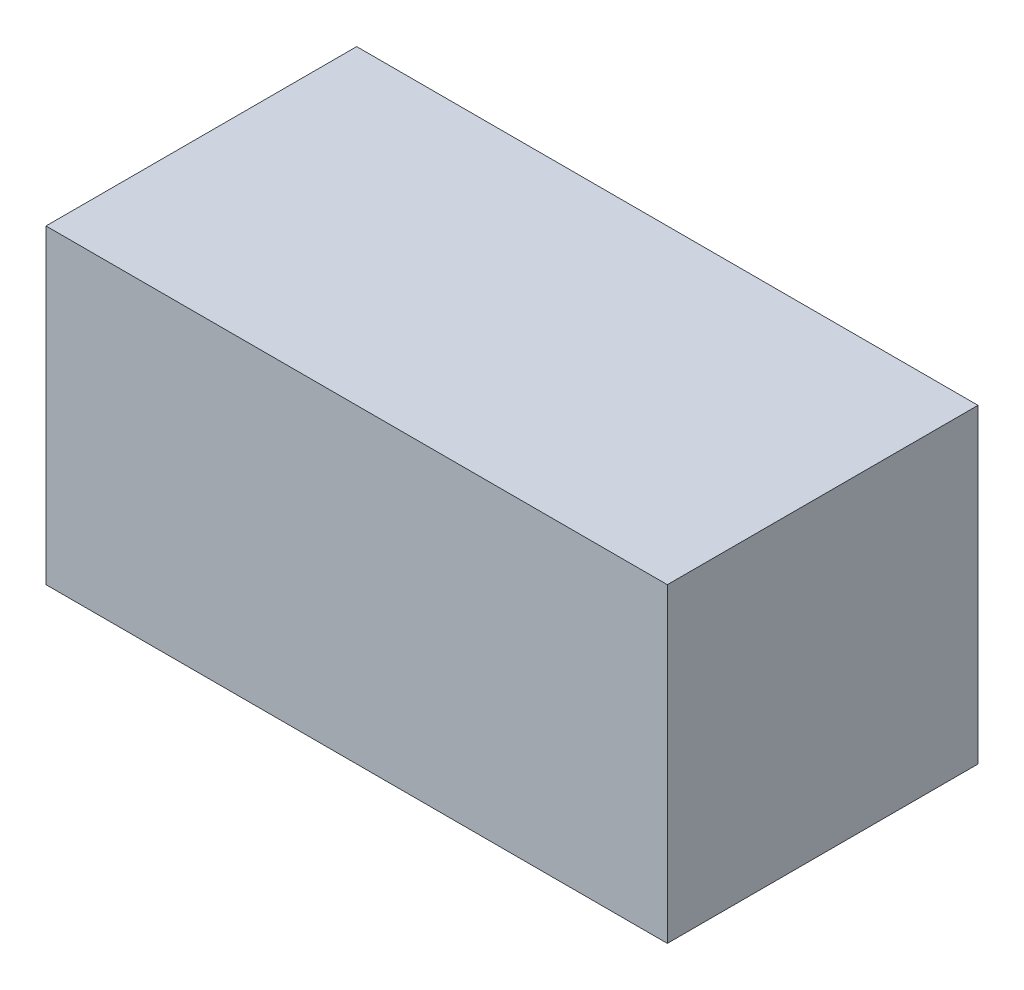
ISO-10303-21;
HEADER;
FILE_DESCRIPTION(('STEP AP214'),'2;1');
FILE_NAME('part.step','',(''),(''),'','','');
FILE_SCHEMA(('AUTOMOTIVE_DESIGN { 1 0 10303 214 1 1 1 1 }'));
ENDSEC;
DATA;
#1=APPLICATION_CONTEXT('core data for automotive mechanical design processes');
#2=APPLICATION_PROTOCOL_DEFINITION('international standard','automotive_design',2000,#1);
#3=PRODUCT_CONTEXT('',#1,'mechanical');
#4=PRODUCT('Part','Part','',(#3));
#5=PRODUCT_RELATED_PRODUCT_CATEGORY('part','',(#4));
#6=PRODUCT_DEFINITION_FORMATION('','',#4);
#7=PRODUCT_DEFINITION_CONTEXT('part definition',#1,'design');
#8=PRODUCT_DEFINITION('design','',#6,#7);
#9=PRODUCT_DEFINITION_SHAPE('','',#8);
#10=(LENGTH_UNIT() NAMED_UNIT(*) SI_UNIT(.MILLI.,.METRE.));
#11=(NAMED_UNIT(*) PLANE_ANGLE_UNIT() SI_UNIT($,.RADIAN.));
#12=(NAMED_UNIT(*) SI_UNIT($,.STERADIAN.) SOLID_ANGLE_UNIT());
#13=UNCERTAINTY_MEASURE_WITH_UNIT(LENGTH_MEASURE(1.E-05),#10,'distance_accuracy_value','');
#14=(GEOMETRIC_REPRESENTATION_CONTEXT(3) GLOBAL_UNCERTAINTY_ASSIGNED_CONTEXT((#13)) GLOBAL_UNIT_ASSIGNED_CONTEXT((#10,
#11,#12)) REPRESENTATION_CONTEXT('',''));
#15=CARTESIAN_POINT('',(0.,0.,0.));
#16=DIRECTION('',(0.,0.,1.));
#17=DIRECTION('',(1.,0.,0.));
#18=AXIS2_PLACEMENT_3D('',#15,#16,#17);
#19=CARTESIAN_POINT('',(50.,-25.,50.));
#20=DIRECTION('',(-1.,0.,0.));
#21=DIRECTION('',(0.,0.,1.));
#22=AXIS2_PLACEMENT_3D('',#19,#20,#21);
#23=PLANE('',#22);
#24=DIRECTION('',(0.,1.,0.));
#25=VECTOR('',#24,1.);
#26=CARTESIAN_POINT('',(50.,-25.,0.));
#27=LINE('',#26,#25);
#28=CARTESIAN_POINT('',(50.,-25.,0.));
#29=VERTEX_POINT('',#28);
#30=CARTESIAN_POINT('',(50.,25.,0.));
#31=VERTEX_POINT('',#30);
#32=EDGE_CURVE('E113',#29,#31,#27,.T.);
#33=ORIENTED_EDGE('',*,*,#32,.T.);
#34=DIRECTION('',(0.,0.,-1.));
#35=VECTOR('',#34,1.);
#36=CARTESIAN_POINT('',(50.,25.,50.));
#37=LINE('',#36,#35);
#38=CARTESIAN_POINT('',(50.,25.,50.));
#39=VERTEX_POINT('',#38);
#40=EDGE_CURVE('E11',#39,#31,#37,.T.);
#41=ORIENTED_EDGE('',*,*,#40,.F.);
#42=DIRECTION('',(0.,1.,0.));
#43=VECTOR('',#42,1.);
#44=CARTESIAN_POINT('',(50.,-25.,50.));
#45=LINE('',#44,#43);
#46=CARTESIAN_POINT('',(50.,-25.,50.));
#47=VERTEX_POINT('',#46);
#48=EDGE_CURVE('E97',#47,#39,#45,.T.);
#49=ORIENTED_EDGE('',*,*,#48,.F.);
#50=DIRECTION('',(0.,0.,-1.));
#51=VECTOR('',#50,1.);
#52=CARTESIAN_POINT('',(50.,-25.,50.));
#53=LINE('',#52,#51);
#54=EDGE_CURVE('E109',#47,#29,#53,.T.);
#55=ORIENTED_EDGE('',*,*,#54,.T.);
#56=EDGE_LOOP('',(#33,#41,#49,#55));
#57=FACE_BOUND('',#56,.T.);
#58=ADVANCED_FACE('F45',(#57),#23,.F.);
#59=CARTESIAN_POINT('',(-50.,25.,50.));
#60=DIRECTION('',(0.,-1.,0.));
#61=DIRECTION('',(0.,0.,-1.));
#62=AXIS2_PLACEMENT_3D('',#59,#60,#61);
#63=PLANE('',#62);
#64=DIRECTION('',(-1.,0.,0.));
#65=VECTOR('',#64,1.);
#66=CARTESIAN_POINT('',(-50.,25.,0.));
#67=LINE('',#66,#65);
#68=CARTESIAN_POINT('',(-50.,25.,0.));
#69=VERTEX_POINT('',#68);
#70=EDGE_CURVE('E102',#31,#69,#67,.T.);
#71=ORIENTED_EDGE('',*,*,#70,.T.);
#72=DIRECTION('',(0.,0.,-1.));
#73=VECTOR('',#72,1.);
#74=CARTESIAN_POINT('',(-50.,25.,50.));
#75=LINE('',#74,#73);
#76=CARTESIAN_POINT('',(-50.,25.,50.));
#77=VERTEX_POINT('',#76);
#78=EDGE_CURVE('E54',#77,#69,#75,.T.);
#79=ORIENTED_EDGE('',*,*,#78,.F.);
#80=DIRECTION('',(-1.,0.,0.));
#81=VECTOR('',#80,1.);
#82=CARTESIAN_POINT('',(-50.,25.,50.));
#83=LINE('',#82,#81);
#84=EDGE_CURVE('E92',#39,#77,#83,.T.);
#85=ORIENTED_EDGE('',*,*,#84,.F.);
#86=ORIENTED_EDGE('',*,*,#40,.T.);
#87=EDGE_LOOP('',(#71,#79,#85,#86));
#88=FACE_BOUND('',#87,.T.);
#89=ADVANCED_FACE('F101',(#88),#63,.F.);
#90=CARTESIAN_POINT('',(-50.,-25.,50.));
#91=DIRECTION('',(1.,0.,0.));
#92=DIRECTION('',(0.,0.,-1.));
#93=AXIS2_PLACEMENT_3D('',#90,#91,#92);
#94=PLANE('',#93);
#95=DIRECTION('',(0.,-1.,0.));
#96=VECTOR('',#95,1.);
#97=CARTESIAN_POINT('',(-50.,-25.,0.));
#98=LINE('',#97,#96);
#99=CARTESIAN_POINT('',(-50.,-25.,0.));
#100=VERTEX_POINT('',#99);
#101=EDGE_CURVE('E79',#69,#100,#98,.T.);
#102=ORIENTED_EDGE('',*,*,#101,.T.);
#103=DIRECTION('',(0.,0.,-1.));
#104=VECTOR('',#103,1.);
#105=CARTESIAN_POINT('',(-50.,-25.,50.));
#106=LINE('',#105,#104);
#107=CARTESIAN_POINT('',(-50.,-25.,50.));
#108=VERTEX_POINT('',#107);
#109=EDGE_CURVE('E104',#108,#100,#106,.T.);
#110=ORIENTED_EDGE('',*,*,#109,.F.);
#111=DIRECTION('',(0.,-1.,0.));
#112=VECTOR('',#111,1.);
#113=CARTESIAN_POINT('',(-50.,-25.,50.));
#114=LINE('',#113,#112);
#115=EDGE_CURVE('E95',#77,#108,#114,.T.);
#116=ORIENTED_EDGE('',*,*,#115,.F.);
#117=ORIENTED_EDGE('',*,*,#78,.T.);
#118=EDGE_LOOP('',(#102,#110,#116,#117));
#119=FACE_BOUND('',#118,.T.);
#120=ADVANCED_FACE('F105',(#119),#94,.F.);
#121=CARTESIAN_POINT('',(-50.,-25.,50.));
#122=DIRECTION('',(0.,1.,0.));
#123=DIRECTION('',(0.,0.,1.));
#124=AXIS2_PLACEMENT_3D('',#121,#122,#123);
#125=PLANE('',#124);
#126=DIRECTION('',(1.,0.,0.));
#127=VECTOR('',#126,1.);
#128=CARTESIAN_POINT('',(-50.,-25.,0.));
#129=LINE('',#128,#127);
#130=EDGE_CURVE('E85',#100,#29,#129,.T.);
#131=ORIENTED_EDGE('',*,*,#130,.T.);
#132=ORIENTED_EDGE('',*,*,#54,.F.);
#133=DIRECTION('',(1.,0.,0.));
#134=VECTOR('',#133,1.);
#135=CARTESIAN_POINT('',(-50.,-25.,50.));
#136=LINE('',#135,#134);
#137=EDGE_CURVE('E62',#108,#47,#136,.T.);
#138=ORIENTED_EDGE('',*,*,#137,.F.);
#139=ORIENTED_EDGE('',*,*,#109,.T.);
#140=EDGE_LOOP('',(#131,#132,#138,#139));
#141=FACE_BOUND('',#140,.T.);
#142=ADVANCED_FACE('F126',(#141),#125,.F.);
#143=CARTESIAN_POINT('',(0.,0.,50.));
#144=DIRECTION('',(0.,0.,-1.));
#145=DIRECTION('',(-1.,0.,0.));
#146=AXIS2_PLACEMENT_3D('',#143,#144,#145);
#147=PLANE('',#146);
#148=ORIENTED_EDGE('',*,*,#48,.T.);
#149=ORIENTED_EDGE('',*,*,#84,.T.);
#150=ORIENTED_EDGE('',*,*,#115,.T.);
#151=ORIENTED_EDGE('',*,*,#137,.T.);
#152=EDGE_LOOP('',(#148,#149,#150,#151));
#153=FACE_BOUND('',#152,.T.);
#154=ADVANCED_FACE('F93',(#153),#147,.F.);
#155=CARTESIAN_POINT('',(0.,0.,0.));
#156=DIRECTION('',(0.,0.,-1.));
#157=DIRECTION('',(-1.,0.,0.));
#158=AXIS2_PLACEMENT_3D('',#155,#156,#157);
#159=PLANE('',#158);
#160=ORIENTED_EDGE('',*,*,#32,.F.);
#161=ORIENTED_EDGE('',*,*,#130,.F.);
#162=ORIENTED_EDGE('',*,*,#101,.F.);
#163=ORIENTED_EDGE('',*,*,#70,.F.);
#164=EDGE_LOOP('',(#160,#161,#162,#163));
#165=FACE_BOUND('',#164,.T.);
#166=ADVANCED_FACE('F129',(#165),#159,.T.);
#167=CLOSED_SHELL('',(#58,#89,#120,#142,#154,#166));
#168=MANIFOLD_SOLID_BREP('B2',#167);
#169=ADVANCED_BREP_SHAPE_REPRESENTATION('',(#18,#168),#14);
#170=SHAPE_DEFINITION_REPRESENTATION(#9,#169);
ENDSEC;
END-ISO-10303-21;
